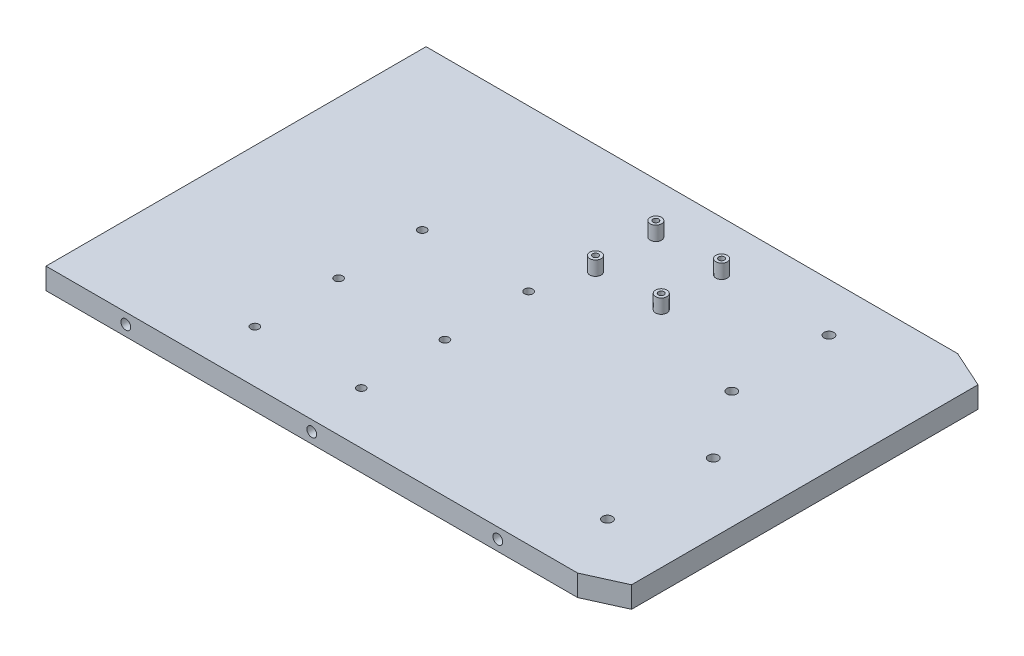
ISO-10303-21;
HEADER;
FILE_DESCRIPTION(('STEP AP214'),'2;1');
FILE_NAME('part.step','',(''),(''),'','','');
FILE_SCHEMA(('AUTOMOTIVE_DESIGN { 1 0 10303 214 1 1 1 1 }'));
ENDSEC;
DATA;
#1=APPLICATION_CONTEXT('core data for automotive mechanical design processes');
#2=APPLICATION_PROTOCOL_DEFINITION('international standard','automotive_design',2000,#1);
#3=PRODUCT_CONTEXT('',#1,'mechanical');
#4=PRODUCT('Part','Part','',(#3));
#5=PRODUCT_RELATED_PRODUCT_CATEGORY('part','',(#4));
#6=PRODUCT_DEFINITION_FORMATION('','',#4);
#7=PRODUCT_DEFINITION_CONTEXT('part definition',#1,'design');
#8=PRODUCT_DEFINITION('design','',#6,#7);
#9=PRODUCT_DEFINITION_SHAPE('','',#8);
#10=(LENGTH_UNIT() NAMED_UNIT(*) SI_UNIT(.MILLI.,.METRE.));
#11=(NAMED_UNIT(*) PLANE_ANGLE_UNIT() SI_UNIT($,.RADIAN.));
#12=(NAMED_UNIT(*) SI_UNIT($,.STERADIAN.) SOLID_ANGLE_UNIT());
#13=UNCERTAINTY_MEASURE_WITH_UNIT(LENGTH_MEASURE(1.E-05),#10,'distance_accuracy_value','');
#14=(GEOMETRIC_REPRESENTATION_CONTEXT(3) GLOBAL_UNCERTAINTY_ASSIGNED_CONTEXT((#13)) GLOBAL_UNIT_ASSIGNED_CONTEXT((#10,
#11,#12)) REPRESENTATION_CONTEXT('',''));
#15=CARTESIAN_POINT('',(0.,0.,0.));
#16=DIRECTION('',(0.,0.,1.));
#17=DIRECTION('',(1.,0.,0.));
#18=AXIS2_PLACEMENT_3D('',#15,#16,#17);
#19=CARTESIAN_POINT('',(243.541302820561,25.,-239.127002178664));
#20=DIRECTION('',(0.,-1.,0.));
#21=DIRECTION('',(0.,0.,-1.));
#22=AXIS2_PLACEMENT_3D('',#19,#20,#21);
#23=PLANE('',#22);
#24=CARTESIAN_POINT('',(243.541302820561,25.,-239.127002178664));
#25=DIRECTION('',(0.,1.,0.));
#26=DIRECTION('',(0.,0.,-1.));
#27=AXIS2_PLACEMENT_3D('',#24,#25,#26);
#28=CIRCLE('',#27,4.);
#29=CARTESIAN_POINT('',(243.541302820561,25.,-243.127002178664));
#30=VERTEX_POINT('',#29);
#31=EDGE_CURVE('E59',#30,#30,#28,.T.);
#32=ORIENTED_EDGE('',*,*,#31,.T.);
#33=EDGE_LOOP('',(#32));
#34=FACE_BOUND('',#33,.T.);
#35=CARTESIAN_POINT('',(243.541302820561,25.,-239.127002178664));
#36=DIRECTION('',(0.,1.,0.));
#37=DIRECTION('',(0.,0.,-1.));
#38=AXIS2_PLACEMENT_3D('',#35,#36,#37);
#39=CIRCLE('',#38,2.);
#40=CARTESIAN_POINT('',(243.541302820561,25.,-241.127002178664));
#41=VERTEX_POINT('',#40);
#42=EDGE_CURVE('E50',#41,#41,#39,.T.);
#43=ORIENTED_EDGE('',*,*,#42,.F.);
#44=EDGE_LOOP('',(#43));
#45=FACE_BOUND('',#44,.T.);
#46=ADVANCED_FACE('F46',(#34,#45),#23,.F.);
#47=CARTESIAN_POINT('',(243.541302820561,15.,-239.127002178664));
#48=DIRECTION('',(0.,-1.,0.));
#49=DIRECTION('',(0.,0.,-1.));
#50=AXIS2_PLACEMENT_3D('',#47,#48,#49);
#51=PLANE('',#50);
#52=CARTESIAN_POINT('',(243.541302820561,15.,-239.127002178664));
#53=DIRECTION('',(0.,1.,0.));
#54=DIRECTION('',(0.,0.,-1.));
#55=AXIS2_PLACEMENT_3D('',#52,#53,#54);
#56=CIRCLE('',#55,4.);
#57=CARTESIAN_POINT('',(243.541302820561,15.,-243.127002178664));
#58=VERTEX_POINT('',#57);
#59=EDGE_CURVE('E57',#58,#58,#56,.T.);
#60=ORIENTED_EDGE('',*,*,#59,.F.);
#61=EDGE_LOOP('',(#60));
#62=FACE_BOUND('',#61,.T.);
#63=CARTESIAN_POINT('',(243.541302820561,15.,-239.127002178664));
#64=DIRECTION('',(0.,1.,0.));
#65=DIRECTION('',(0.,0.,-1.));
#66=AXIS2_PLACEMENT_3D('',#63,#64,#65);
#67=CIRCLE('',#66,2.);
#68=CARTESIAN_POINT('',(243.541302820561,15.,-241.127002178664));
#69=VERTEX_POINT('',#68);
#70=EDGE_CURVE('E11',#69,#69,#67,.T.);
#71=ORIENTED_EDGE('',*,*,#70,.T.);
#72=EDGE_LOOP('',(#71));
#73=FACE_BOUND('',#72,.T.);
#74=ADVANCED_FACE('F67',(#62,#73),#51,.T.);
#75=CARTESIAN_POINT('',(243.541302820561,25.,-239.127002178664));
#76=DIRECTION('',(0.,-1.,0.));
#77=DIRECTION('',(0.,0.,-1.));
#78=AXIS2_PLACEMENT_3D('',#75,#76,#77);
#79=CYLINDRICAL_SURFACE('',#78,4.);
#80=ORIENTED_EDGE('',*,*,#31,.F.);
#81=EDGE_LOOP('',(#80));
#82=FACE_BOUND('',#81,.T.);
#83=ORIENTED_EDGE('',*,*,#59,.T.);
#84=EDGE_LOOP('',(#83));
#85=FACE_BOUND('',#84,.T.);
#86=ADVANCED_FACE('F65',(#82,#85),#79,.T.);
#87=CARTESIAN_POINT('',(243.541302820561,25.,-239.127002178664));
#88=DIRECTION('',(0.,-1.,0.));
#89=DIRECTION('',(0.,0.,-1.));
#90=AXIS2_PLACEMENT_3D('',#87,#88,#89);
#91=CYLINDRICAL_SURFACE('',#90,2.);
#92=ORIENTED_EDGE('',*,*,#42,.T.);
#93=EDGE_LOOP('',(#92));
#94=FACE_BOUND('',#93,.T.);
#95=ORIENTED_EDGE('',*,*,#70,.F.);
#96=EDGE_LOOP('',(#95));
#97=FACE_BOUND('',#96,.T.);
#98=ADVANCED_FACE('F48',(#94,#97),#91,.F.);
#99=CLOSED_SHELL('',(#46,#74,#86,#98));
#100=MANIFOLD_SOLID_BREP('B2',#99);
#101=CARTESIAN_POINT('',(197.186302820561,25.,-239.127002178664));
#102=DIRECTION('',(0.,-1.,0.));
#103=DIRECTION('',(0.,0.,-1.));
#104=AXIS2_PLACEMENT_3D('',#101,#102,#103);
#105=PLANE('',#104);
#106=CARTESIAN_POINT('',(197.186302820561,25.,-239.127002178664));
#107=DIRECTION('',(0.,1.,0.));
#108=DIRECTION('',(0.,0.,-1.));
#109=AXIS2_PLACEMENT_3D('',#106,#107,#108);
#110=CIRCLE('',#109,3.99999999999999);
#111=CARTESIAN_POINT('',(197.186302820561,25.,-243.127002178664));
#112=VERTEX_POINT('',#111);
#113=EDGE_CURVE('E137',#112,#112,#110,.T.);
#114=ORIENTED_EDGE('',*,*,#113,.T.);
#115=EDGE_LOOP('',(#114));
#116=FACE_BOUND('',#115,.T.);
#117=CARTESIAN_POINT('',(197.186302820561,25.,-239.127002178664));
#118=DIRECTION('',(0.,1.,0.));
#119=DIRECTION('',(0.,0.,-1.));
#120=AXIS2_PLACEMENT_3D('',#117,#118,#119);
#121=CIRCLE('',#120,2.);
#122=CARTESIAN_POINT('',(197.186302820561,25.,-241.127002178664));
#123=VERTEX_POINT('',#122);
#124=EDGE_CURVE('E128',#123,#123,#121,.T.);
#125=ORIENTED_EDGE('',*,*,#124,.F.);
#126=EDGE_LOOP('',(#125));
#127=FACE_BOUND('',#126,.T.);
#128=ADVANCED_FACE('F124',(#116,#127),#105,.F.);
#129=CARTESIAN_POINT('',(197.186302820561,15.,-239.127002178664));
#130=DIRECTION('',(0.,-1.,0.));
#131=DIRECTION('',(0.,0.,-1.));
#132=AXIS2_PLACEMENT_3D('',#129,#130,#131);
#133=PLANE('',#132);
#134=CARTESIAN_POINT('',(197.186302820561,15.,-239.127002178664));
#135=DIRECTION('',(0.,1.,0.));
#136=DIRECTION('',(0.,0.,-1.));
#137=AXIS2_PLACEMENT_3D('',#134,#135,#136);
#138=CIRCLE('',#137,3.99999999999999);
#139=CARTESIAN_POINT('',(197.186302820561,15.,-243.127002178664));
#140=VERTEX_POINT('',#139);
#141=EDGE_CURVE('E135',#140,#140,#138,.T.);
#142=ORIENTED_EDGE('',*,*,#141,.F.);
#143=EDGE_LOOP('',(#142));
#144=FACE_BOUND('',#143,.T.);
#145=CARTESIAN_POINT('',(197.186302820561,15.,-239.127002178664));
#146=DIRECTION('',(0.,1.,0.));
#147=DIRECTION('',(0.,0.,-1.));
#148=AXIS2_PLACEMENT_3D('',#145,#146,#147);
#149=CIRCLE('',#148,2.);
#150=CARTESIAN_POINT('',(197.186302820561,15.,-241.127002178664));
#151=VERTEX_POINT('',#150);
#152=EDGE_CURVE('E45',#151,#151,#149,.T.);
#153=ORIENTED_EDGE('',*,*,#152,.T.);
#154=EDGE_LOOP('',(#153));
#155=FACE_BOUND('',#154,.T.);
#156=ADVANCED_FACE('F145',(#144,#155),#133,.T.);
#157=CARTESIAN_POINT('',(197.186302820561,25.,-239.127002178664));
#158=DIRECTION('',(0.,-1.,0.));
#159=DIRECTION('',(0.,0.,-1.));
#160=AXIS2_PLACEMENT_3D('',#157,#158,#159);
#161=CYLINDRICAL_SURFACE('',#160,3.99999999999999);
#162=ORIENTED_EDGE('',*,*,#113,.F.);
#163=EDGE_LOOP('',(#162));
#164=FACE_BOUND('',#163,.T.);
#165=ORIENTED_EDGE('',*,*,#141,.T.);
#166=EDGE_LOOP('',(#165));
#167=FACE_BOUND('',#166,.T.);
#168=ADVANCED_FACE('F143',(#164,#167),#161,.T.);
#169=CARTESIAN_POINT('',(197.186302820561,25.,-239.127002178664));
#170=DIRECTION('',(0.,-1.,0.));
#171=DIRECTION('',(0.,0.,-1.));
#172=AXIS2_PLACEMENT_3D('',#169,#170,#171);
#173=CYLINDRICAL_SURFACE('',#172,2.);
#174=ORIENTED_EDGE('',*,*,#124,.T.);
#175=EDGE_LOOP('',(#174));
#176=FACE_BOUND('',#175,.T.);
#177=ORIENTED_EDGE('',*,*,#152,.F.);
#178=EDGE_LOOP('',(#177));
#179=FACE_BOUND('',#178,.T.);
#180=ADVANCED_FACE('F126',(#176,#179),#173,.F.);
#181=CLOSED_SHELL('',(#128,#156,#168,#180));
#182=MANIFOLD_SOLID_BREP('B6',#181);
#183=CARTESIAN_POINT('',(197.186302820561,25.,-196.582002178664));
#184=DIRECTION('',(0.,1.,0.));
#185=DIRECTION('',(0.,0.,1.));
#186=AXIS2_PLACEMENT_3D('',#183,#184,#185);
#187=PLANE('',#186);
#188=CARTESIAN_POINT('',(197.186302820561,25.,-196.582002178664));
#189=DIRECTION('',(0.,1.,0.));
#190=DIRECTION('',(0.,0.,1.));
#191=AXIS2_PLACEMENT_3D('',#188,#189,#190);
#192=CIRCLE('',#191,4.);
#193=CARTESIAN_POINT('',(197.186302820561,25.,-192.582002178664));
#194=VERTEX_POINT('',#193);
#195=EDGE_CURVE('E215',#194,#194,#192,.T.);
#196=ORIENTED_EDGE('',*,*,#195,.T.);
#197=EDGE_LOOP('',(#196));
#198=FACE_BOUND('',#197,.T.);
#199=CARTESIAN_POINT('',(197.186302820561,25.,-196.582002178664));
#200=DIRECTION('',(0.,1.,0.));
#201=DIRECTION('',(0.,0.,1.));
#202=AXIS2_PLACEMENT_3D('',#199,#200,#201);
#203=CIRCLE('',#202,2.);
#204=CARTESIAN_POINT('',(197.186302820561,25.,-194.582002178664));
#205=VERTEX_POINT('',#204);
#206=EDGE_CURVE('E206',#205,#205,#203,.T.);
#207=ORIENTED_EDGE('',*,*,#206,.F.);
#208=EDGE_LOOP('',(#207));
#209=FACE_BOUND('',#208,.T.);
#210=ADVANCED_FACE('F202',(#198,#209),#187,.T.);
#211=CARTESIAN_POINT('',(197.186302820561,15.,-196.582002178664));
#212=DIRECTION('',(0.,1.,0.));
#213=DIRECTION('',(0.,0.,1.));
#214=AXIS2_PLACEMENT_3D('',#211,#212,#213);
#215=PLANE('',#214);
#216=CARTESIAN_POINT('',(197.186302820561,15.,-196.582002178664));
#217=DIRECTION('',(0.,1.,0.));
#218=DIRECTION('',(0.,0.,1.));
#219=AXIS2_PLACEMENT_3D('',#216,#217,#218);
#220=CIRCLE('',#219,4.);
#221=CARTESIAN_POINT('',(197.186302820561,15.,-192.582002178664));
#222=VERTEX_POINT('',#221);
#223=EDGE_CURVE('E213',#222,#222,#220,.T.);
#224=ORIENTED_EDGE('',*,*,#223,.F.);
#225=EDGE_LOOP('',(#224));
#226=FACE_BOUND('',#225,.T.);
#227=CARTESIAN_POINT('',(197.186302820561,15.,-196.582002178664));
#228=DIRECTION('',(0.,1.,0.));
#229=DIRECTION('',(0.,0.,1.));
#230=AXIS2_PLACEMENT_3D('',#227,#228,#229);
#231=CIRCLE('',#230,2.);
#232=CARTESIAN_POINT('',(197.186302820561,15.,-194.582002178664));
#233=VERTEX_POINT('',#232);
#234=EDGE_CURVE('E123',#233,#233,#231,.T.);
#235=ORIENTED_EDGE('',*,*,#234,.T.);
#236=EDGE_LOOP('',(#235));
#237=FACE_BOUND('',#236,.T.);
#238=ADVANCED_FACE('F223',(#226,#237),#215,.F.);
#239=CARTESIAN_POINT('',(197.186302820561,25.,-196.582002178664));
#240=DIRECTION('',(0.,-1.,0.));
#241=DIRECTION('',(0.,0.,-1.));
#242=AXIS2_PLACEMENT_3D('',#239,#240,#241);
#243=CYLINDRICAL_SURFACE('',#242,4.);
#244=ORIENTED_EDGE('',*,*,#195,.F.);
#245=EDGE_LOOP('',(#244));
#246=FACE_BOUND('',#245,.T.);
#247=ORIENTED_EDGE('',*,*,#223,.T.);
#248=EDGE_LOOP('',(#247));
#249=FACE_BOUND('',#248,.T.);
#250=ADVANCED_FACE('F221',(#246,#249),#243,.T.);
#251=CARTESIAN_POINT('',(197.186302820561,25.,-196.582002178664));
#252=DIRECTION('',(0.,-1.,0.));
#253=DIRECTION('',(0.,0.,-1.));
#254=AXIS2_PLACEMENT_3D('',#251,#252,#253);
#255=CYLINDRICAL_SURFACE('',#254,2.);
#256=ORIENTED_EDGE('',*,*,#206,.T.);
#257=EDGE_LOOP('',(#256));
#258=FACE_BOUND('',#257,.T.);
#259=ORIENTED_EDGE('',*,*,#234,.F.);
#260=EDGE_LOOP('',(#259));
#261=FACE_BOUND('',#260,.T.);
#262=ADVANCED_FACE('F204',(#258,#261),#255,.F.);
#263=CLOSED_SHELL('',(#210,#238,#250,#262));
#264=MANIFOLD_SOLID_BREP('B40',#263);
#265=CARTESIAN_POINT('',(243.541302820561,25.,-196.582002178664));
#266=DIRECTION('',(0.,1.,0.));
#267=DIRECTION('',(0.,0.,1.));
#268=AXIS2_PLACEMENT_3D('',#265,#266,#267);
#269=PLANE('',#268);
#270=CARTESIAN_POINT('',(243.541302820561,25.,-196.582002178664));
#271=DIRECTION('',(0.,1.,0.));
#272=DIRECTION('',(0.,0.,1.));
#273=AXIS2_PLACEMENT_3D('',#270,#271,#272);
#274=CIRCLE('',#273,4.);
#275=CARTESIAN_POINT('',(243.541302820561,25.,-192.582002178664));
#276=VERTEX_POINT('',#275);
#277=EDGE_CURVE('E201',#276,#276,#274,.T.);
#278=ORIENTED_EDGE('',*,*,#277,.T.);
#279=EDGE_LOOP('',(#278));
#280=FACE_BOUND('',#279,.T.);
#281=CARTESIAN_POINT('',(243.541302820561,25.,-196.582002178664));
#282=DIRECTION('',(0.,1.,0.));
#283=DIRECTION('',(0.,0.,1.));
#284=AXIS2_PLACEMENT_3D('',#281,#282,#283);
#285=CIRCLE('',#284,2.);
#286=CARTESIAN_POINT('',(243.541302820561,25.,-194.582002178664));
#287=VERTEX_POINT('',#286);
#288=EDGE_CURVE('E292',#287,#287,#285,.T.);
#289=ORIENTED_EDGE('',*,*,#288,.F.);
#290=EDGE_LOOP('',(#289));
#291=FACE_BOUND('',#290,.T.);
#292=ADVANCED_FACE('F281',(#280,#291),#269,.T.);
#293=CARTESIAN_POINT('',(243.541302820561,15.,-196.582002178664));
#294=DIRECTION('',(0.,1.,0.));
#295=DIRECTION('',(0.,0.,1.));
#296=AXIS2_PLACEMENT_3D('',#293,#294,#295);
#297=PLANE('',#296);
#298=CARTESIAN_POINT('',(243.541302820561,15.,-196.582002178664));
#299=DIRECTION('',(0.,1.,0.));
#300=DIRECTION('',(0.,0.,1.));
#301=AXIS2_PLACEMENT_3D('',#298,#299,#300);
#302=CIRCLE('',#301,4.);
#303=CARTESIAN_POINT('',(243.541302820561,15.,-192.582002178664));
#304=VERTEX_POINT('',#303);
#305=EDGE_CURVE('E285',#304,#304,#302,.T.);
#306=ORIENTED_EDGE('',*,*,#305,.F.);
#307=EDGE_LOOP('',(#306));
#308=FACE_BOUND('',#307,.T.);
#309=CARTESIAN_POINT('',(243.541302820561,15.,-196.582002178664));
#310=DIRECTION('',(0.,1.,0.));
#311=DIRECTION('',(0.,0.,1.));
#312=AXIS2_PLACEMENT_3D('',#309,#310,#311);
#313=CIRCLE('',#312,2.);
#314=CARTESIAN_POINT('',(243.541302820561,15.,-194.582002178664));
#315=VERTEX_POINT('',#314);
#316=EDGE_CURVE('E294',#315,#315,#313,.T.);
#317=ORIENTED_EDGE('',*,*,#316,.T.);
#318=EDGE_LOOP('',(#317));
#319=FACE_BOUND('',#318,.T.);
#320=ADVANCED_FACE('F304',(#308,#319),#297,.F.);
#321=CARTESIAN_POINT('',(243.541302820561,25.,-196.582002178664));
#322=DIRECTION('',(0.,-1.,0.));
#323=DIRECTION('',(0.,0.,-1.));
#324=AXIS2_PLACEMENT_3D('',#321,#322,#323);
#325=CYLINDRICAL_SURFACE('',#324,4.);
#326=ORIENTED_EDGE('',*,*,#277,.F.);
#327=EDGE_LOOP('',(#326));
#328=FACE_BOUND('',#327,.T.);
#329=ORIENTED_EDGE('',*,*,#305,.T.);
#330=EDGE_LOOP('',(#329));
#331=FACE_BOUND('',#330,.T.);
#332=ADVANCED_FACE('F283',(#328,#331),#325,.T.);
#333=CARTESIAN_POINT('',(243.541302820561,25.,-196.582002178664));
#334=DIRECTION('',(0.,-1.,0.));
#335=DIRECTION('',(0.,0.,-1.));
#336=AXIS2_PLACEMENT_3D('',#333,#334,#335);
#337=CYLINDRICAL_SURFACE('',#336,2.);
#338=ORIENTED_EDGE('',*,*,#288,.T.);
#339=EDGE_LOOP('',(#338));
#340=FACE_BOUND('',#339,.T.);
#341=ORIENTED_EDGE('',*,*,#316,.F.);
#342=EDGE_LOOP('',(#341));
#343=FACE_BOUND('',#342,.T.);
#344=ADVANCED_FACE('F300',(#340,#343),#337,.F.);
#345=CLOSED_SHELL('',(#292,#320,#332,#344));
#346=MANIFOLD_SOLID_BREP('B118',#345);
#347=CARTESIAN_POINT('',(374.81,10.,-12.0330845771143));
#348=DIRECTION('',(0.,0.,-1.));
#349=DIRECTION('',(-1.,0.,0.));
#350=AXIS2_PLACEMENT_3D('',#347,#348,#349);
#351=PLANE('',#350);
#352=CARTESIAN_POINT('',(187.405,7.5,-12.0330845771144));
#353=DIRECTION('',(0.,0.,1.));
#354=DIRECTION('',(1.,0.,0.));
#355=AXIS2_PLACEMENT_3D('',#352,#353,#354);
#356=CIRCLE('',#355,3.45500000000002);
#357=CARTESIAN_POINT('',(190.86,7.5,-12.0330845771144));
#358=VERTEX_POINT('',#357);
#359=EDGE_CURVE('E502',#358,#358,#356,.T.);
#360=ORIENTED_EDGE('',*,*,#359,.T.);
#361=EDGE_LOOP('',(#360));
#362=FACE_BOUND('',#361,.T.);
#363=ADVANCED_FACE('F351',(#362),#351,.F.);
#364=CARTESIAN_POINT('',(56.2694258644328,7.5,-12.0330845771144));
#365=DIRECTION('',(0.,0.,1.));
#366=DIRECTION('',(1.,0.,0.));
#367=AXIS2_PLACEMENT_3D('',#364,#365,#366);
#368=CIRCLE('',#367,3.45500000000002);
#369=CARTESIAN_POINT('',(59.7244258644328,7.5,-12.0330845771144));
#370=VERTEX_POINT('',#369);
#371=EDGE_CURVE('E492',#370,#370,#368,.T.);
#372=ORIENTED_EDGE('',*,*,#371,.T.);
#373=EDGE_LOOP('',(#372));
#374=FACE_BOUND('',#373,.T.);
#375=ADVANCED_FACE('F467',(#374),#351,.F.);
#376=CARTESIAN_POINT('',(318.540574135567,7.5,-12.0330845771144));
#377=DIRECTION('',(0.,0.,1.));
#378=DIRECTION('',(-1.,0.,0.));
#379=AXIS2_PLACEMENT_3D('',#376,#377,#378);
#380=CIRCLE('',#379,3.45500000000004);
#381=CARTESIAN_POINT('',(315.085574135567,7.5,-12.0330845771144));
#382=VERTEX_POINT('',#381);
#383=EDGE_CURVE('E486',#382,#382,#380,.T.);
#384=ORIENTED_EDGE('',*,*,#383,.T.);
#385=EDGE_LOOP('',(#384));
#386=FACE_BOUND('',#385,.T.);
#387=ADVANCED_FACE('F470',(#386),#351,.F.);
#388=CARTESIAN_POINT('',(401.01,10.,-18.185));
#389=DIRECTION('',(-0.412154431079065,0.,-0.911114002165422));
#390=DIRECTION('',(-0.911114002165422,0.,0.412154431079065));
#391=AXIS2_PLACEMENT_3D('',#388,#389,#390);
#392=PLANE('',#391);
#393=DIRECTION('',(0.911114002165422,0.,-0.412154431079065));
#394=VECTOR('',#393,1.);
#395=CARTESIAN_POINT('',(401.01,0.,-18.185));
#396=LINE('',#395,#394);
#397=CARTESIAN_POINT('',(374.81,0.,-6.33308457711444));
#398=VERTEX_POINT('',#397);
#399=CARTESIAN_POINT('',(401.01,0.,-18.185));
#400=VERTEX_POINT('',#399);
#401=EDGE_CURVE('E428',#398,#400,#396,.T.);
#402=ORIENTED_EDGE('',*,*,#401,.T.);
#403=DIRECTION('',(0.,-1.,0.));
#404=VECTOR('',#403,1.);
#405=CARTESIAN_POINT('',(401.01,10.,-18.185));
#406=LINE('',#405,#404);
#407=CARTESIAN_POINT('',(401.01,15.,-18.185));
#408=VERTEX_POINT('',#407);
#409=EDGE_CURVE('E435',#408,#400,#406,.T.);
#410=ORIENTED_EDGE('',*,*,#409,.F.);
#411=DIRECTION('',(0.911114002165422,0.,-0.412154431079065));
#412=VECTOR('',#411,1.);
#413=CARTESIAN_POINT('',(61.2912547537158,15.,135.491253291138));
#414=LINE('',#413,#412);
#415=CARTESIAN_POINT('',(374.81,15.,-6.33308457711435));
#416=VERTEX_POINT('',#415);
#417=EDGE_CURVE('E547',#416,#408,#414,.T.);
#418=ORIENTED_EDGE('',*,*,#417,.F.);
#419=DIRECTION('',(0.,-1.,0.));
#420=VECTOR('',#419,1.);
#421=CARTESIAN_POINT('',(374.81,10.,-6.33308457711435));
#422=LINE('',#421,#420);
#423=EDGE_CURVE('E423',#416,#398,#422,.T.);
#424=ORIENTED_EDGE('',*,*,#423,.T.);
#425=EDGE_LOOP('',(#402,#410,#418,#424));
#426=FACE_BOUND('',#425,.T.);
#427=ADVANCED_FACE('F353',(#426),#392,.F.);
#428=CARTESIAN_POINT('',(401.01,10.,-18.185));
#429=DIRECTION('',(-1.,0.,0.));
#430=DIRECTION('',(0.,0.,1.));
#431=AXIS2_PLACEMENT_3D('',#428,#429,#430);
#432=PLANE('',#431);
#433=DIRECTION('',(0.,0.,-1.));
#434=VECTOR('',#433,1.);
#435=CARTESIAN_POINT('',(401.01,0.,-18.185));
#436=LINE('',#435,#434);
#437=CARTESIAN_POINT('',(401.01,0.,-262.445));
#438=VERTEX_POINT('',#437);
#439=EDGE_CURVE('E366',#400,#438,#436,.T.);
#440=ORIENTED_EDGE('',*,*,#439,.T.);
#441=DIRECTION('',(0.,-1.,0.));
#442=VECTOR('',#441,1.);
#443=CARTESIAN_POINT('',(401.01,10.,-262.445));
#444=LINE('',#443,#442);
#445=CARTESIAN_POINT('',(401.01,15.,-262.445));
#446=VERTEX_POINT('',#445);
#447=EDGE_CURVE('E422',#446,#438,#444,.T.);
#448=ORIENTED_EDGE('',*,*,#447,.F.);
#449=DIRECTION('',(0.,0.,-1.));
#450=VECTOR('',#449,1.);
#451=CARTESIAN_POINT('',(401.01,15.,0.));
#452=LINE('',#451,#450);
#453=EDGE_CURVE('E549',#408,#446,#452,.T.);
#454=ORIENTED_EDGE('',*,*,#453,.F.);
#455=ORIENTED_EDGE('',*,*,#409,.T.);
#456=EDGE_LOOP('',(#440,#448,#454,#455));
#457=FACE_BOUND('',#456,.T.);
#458=ADVANCED_FACE('F482',(#457),#432,.F.);
#459=CARTESIAN_POINT('',(401.01,10.,-262.445));
#460=DIRECTION('',(-0.412154431079065,0.,0.911114002165422));
#461=DIRECTION('',(0.911114002165422,0.,0.412154431079065));
#462=AXIS2_PLACEMENT_3D('',#459,#460,#461);
#463=PLANE('',#462);
#464=DIRECTION('',(-0.911114002165422,0.,-0.412154431079065));
#465=VECTOR('',#464,1.);
#466=CARTESIAN_POINT('',(401.01,0.,-262.445));
#467=LINE('',#466,#465);
#468=CARTESIAN_POINT('',(374.81,0.,-274.296915422886));
#469=VERTEX_POINT('',#468);
#470=EDGE_CURVE('E404',#438,#469,#467,.T.);
#471=ORIENTED_EDGE('',*,*,#470,.T.);
#472=DIRECTION('',(0.,-1.,0.));
#473=VECTOR('',#472,1.);
#474=CARTESIAN_POINT('',(374.81,10.,-274.296915422886));
#475=LINE('',#474,#473);
#476=CARTESIAN_POINT('',(374.81,15.,-274.296915422886));
#477=VERTEX_POINT('',#476);
#478=EDGE_CURVE('E414',#477,#469,#475,.T.);
#479=ORIENTED_EDGE('',*,*,#478,.F.);
#480=DIRECTION('',(-0.911114002165422,0.,-0.412154431079065));
#481=VECTOR('',#480,1.);
#482=CARTESIAN_POINT('',(166.673340646823,15.,-368.450277371581));
#483=LINE('',#482,#481);
#484=EDGE_CURVE('E552',#446,#477,#483,.T.);
#485=ORIENTED_EDGE('',*,*,#484,.F.);
#486=ORIENTED_EDGE('',*,*,#447,.T.);
#487=EDGE_LOOP('',(#471,#479,#485,#486));
#488=FACE_BOUND('',#487,.T.);
#489=ADVANCED_FACE('F425',(#488),#463,.F.);
#490=CARTESIAN_POINT('',(0.,10.,-12.0330845771144));
#491=DIRECTION('',(1.,0.,0.));
#492=DIRECTION('',(0.,0.,-1.));
#493=AXIS2_PLACEMENT_3D('',#490,#491,#492);
#494=PLANE('',#493);
#495=DIRECTION('',(0.,0.,1.));
#496=VECTOR('',#495,1.);
#497=CARTESIAN_POINT('',(0.,0.,-12.0330845771144));
#498=LINE('',#497,#496);
#499=CARTESIAN_POINT('',(0.,0.,-274.296915422886));
#500=VERTEX_POINT('',#499);
#501=CARTESIAN_POINT('',(0.,0.,-6.33308457711444));
#502=VERTEX_POINT('',#501);
#503=EDGE_CURVE('E406',#500,#502,#498,.T.);
#504=ORIENTED_EDGE('',*,*,#503,.T.);
#505=DIRECTION('',(0.,-1.,0.));
#506=VECTOR('',#505,1.);
#507=CARTESIAN_POINT('',(0.,0.,-6.33308457711444));
#508=LINE('',#507,#506);
#509=CARTESIAN_POINT('',(0.,15.,-6.33308457711444));
#510=VERTEX_POINT('',#509);
#511=EDGE_CURVE('E508',#510,#502,#508,.T.);
#512=ORIENTED_EDGE('',*,*,#511,.F.);
#513=DIRECTION('',(0.,0.,-1.));
#514=VECTOR('',#513,1.);
#515=CARTESIAN_POINT('',(0.,15.,-6.33308457711444));
#516=LINE('',#515,#514);
#517=CARTESIAN_POINT('',(0.,15.,-274.296915422886));
#518=VERTEX_POINT('',#517);
#519=EDGE_CURVE('E517',#510,#518,#516,.T.);
#520=ORIENTED_EDGE('',*,*,#519,.T.);
#521=DIRECTION('',(0.,1.,0.));
#522=VECTOR('',#521,1.);
#523=CARTESIAN_POINT('',(0.,0.,-274.296915422886));
#524=LINE('',#523,#522);
#525=EDGE_CURVE('E410',#500,#518,#524,.T.);
#526=ORIENTED_EDGE('',*,*,#525,.F.);
#527=EDGE_LOOP('',(#504,#512,#520,#526));
#528=FACE_BOUND('',#527,.T.);
#529=ADVANCED_FACE('F528',(#528),#494,.F.);
#530=CARTESIAN_POINT('',(0.,0.,0.));
#531=DIRECTION('',(0.,-1.,0.));
#532=DIRECTION('',(0.,0.,-1.));
#533=AXIS2_PLACEMENT_3D('',#530,#531,#532);
#534=PLANE('',#533);
#535=ORIENTED_EDGE('',*,*,#503,.F.);
#536=DIRECTION('',(-1.,0.,0.));
#537=VECTOR('',#536,1.);
#538=CARTESIAN_POINT('',(374.81,0.,-274.296915422886));
#539=LINE('',#538,#537);
#540=EDGE_CURVE('E400',#469,#500,#539,.T.);
#541=ORIENTED_EDGE('',*,*,#540,.F.);
#542=ORIENTED_EDGE('',*,*,#470,.F.);
#543=ORIENTED_EDGE('',*,*,#439,.F.);
#544=ORIENTED_EDGE('',*,*,#401,.F.);
#545=DIRECTION('',(1.,0.,0.));
#546=VECTOR('',#545,1.);
#547=CARTESIAN_POINT('',(0.,0.,-6.33308457711444));
#548=LINE('',#547,#546);
#549=EDGE_CURVE('E512',#502,#398,#548,.T.);
#550=ORIENTED_EDGE('',*,*,#549,.F.);
#551=EDGE_LOOP('',(#535,#541,#542,#543,#544,#550));
#552=FACE_BOUND('',#551,.T.);
#553=ADVANCED_FACE('F402',(#552),#534,.T.);
#554=CARTESIAN_POINT('',(0.,0.,-6.33308457711444));
#555=DIRECTION('',(0.,0.,-1.));
#556=DIRECTION('',(-1.,0.,0.));
#557=AXIS2_PLACEMENT_3D('',#554,#555,#556);
#558=PLANE('',#557);
#559=ORIENTED_EDGE('',*,*,#511,.T.);
#560=ORIENTED_EDGE('',*,*,#549,.T.);
#561=ORIENTED_EDGE('',*,*,#423,.F.);
#562=DIRECTION('',(-1.,0.,0.));
#563=VECTOR('',#562,1.);
#564=CARTESIAN_POINT('',(0.,15.,-6.33308457711444));
#565=LINE('',#564,#563);
#566=EDGE_CURVE('E515',#416,#510,#565,.T.);
#567=ORIENTED_EDGE('',*,*,#566,.T.);
#568=EDGE_LOOP('',(#559,#560,#561,#567));
#569=FACE_BOUND('',#568,.T.);
#570=CARTESIAN_POINT('',(187.405,7.5,-6.33308457711444));
#571=DIRECTION('',(0.,0.,1.));
#572=DIRECTION('',(1.,0.,0.));
#573=AXIS2_PLACEMENT_3D('',#570,#571,#572);
#574=CIRCLE('',#573,3.45500000000002);
#575=CARTESIAN_POINT('',(190.86,7.5,-6.33308457711444));
#576=VERTEX_POINT('',#575);
#577=EDGE_CURVE('E505',#576,#576,#574,.T.);
#578=ORIENTED_EDGE('',*,*,#577,.F.);
#579=EDGE_LOOP('',(#578));
#580=FACE_BOUND('',#579,.T.);
#581=CARTESIAN_POINT('',(56.2694258644328,7.5,-6.33308457711444));
#582=DIRECTION('',(0.,0.,1.));
#583=DIRECTION('',(1.,0.,0.));
#584=AXIS2_PLACEMENT_3D('',#581,#582,#583);
#585=CIRCLE('',#584,3.45500000000002);
#586=CARTESIAN_POINT('',(59.7244258644328,7.5,-6.33308457711444));
#587=VERTEX_POINT('',#586);
#588=EDGE_CURVE('E499',#587,#587,#585,.T.);
#589=ORIENTED_EDGE('',*,*,#588,.F.);
#590=EDGE_LOOP('',(#589));
#591=FACE_BOUND('',#590,.T.);
#592=CARTESIAN_POINT('',(318.540574135567,7.5,-6.33308457711444));
#593=DIRECTION('',(0.,0.,1.));
#594=DIRECTION('',(-1.,0.,0.));
#595=AXIS2_PLACEMENT_3D('',#592,#593,#594);
#596=CIRCLE('',#595,3.45500000000004);
#597=CARTESIAN_POINT('',(315.085574135567,7.5,-6.33308457711444));
#598=VERTEX_POINT('',#597);
#599=EDGE_CURVE('E488',#598,#598,#596,.T.);
#600=ORIENTED_EDGE('',*,*,#599,.F.);
#601=EDGE_LOOP('',(#600));
#602=FACE_BOUND('',#601,.T.);
#603=ADVANCED_FACE('F523',(#569,#580,#591,#602),#558,.F.);
#604=CARTESIAN_POINT('',(0.,15.,-6.33308457711444));
#605=DIRECTION('',(0.,-1.,0.));
#606=DIRECTION('',(0.,0.,-1.));
#607=AXIS2_PLACEMENT_3D('',#604,#605,#606);
#608=PLANE('',#607);
#609=DIRECTION('',(1.,0.,0.));
#610=VECTOR('',#609,1.);
#611=CARTESIAN_POINT('',(374.81,15.,-274.296915422886));
#612=LINE('',#611,#610);
#613=EDGE_CURVE('E418',#518,#477,#612,.T.);
#614=ORIENTED_EDGE('',*,*,#613,.F.);
#615=ORIENTED_EDGE('',*,*,#519,.F.);
#616=ORIENTED_EDGE('',*,*,#566,.F.);
#617=ORIENTED_EDGE('',*,*,#417,.T.);
#618=ORIENTED_EDGE('',*,*,#453,.T.);
#619=ORIENTED_EDGE('',*,*,#484,.T.);
#620=EDGE_LOOP('',(#614,#615,#616,#617,#618,#619));
#621=FACE_BOUND('',#620,.T.);
#622=CARTESIAN_POINT('',(110.598476411571,15.,-161.016832693731));
#623=DIRECTION('',(0.,1.,0.));
#624=DIRECTION('',(0.,0.,1.));
#625=AXIS2_PLACEMENT_3D('',#622,#623,#624);
#626=CIRCLE('',#625,2.92500000000001);
#627=CARTESIAN_POINT('',(110.598476411571,15.,-158.091832693731));
#628=VERTEX_POINT('',#627);
#629=EDGE_CURVE('E534',#628,#628,#626,.F.);
#630=ORIENTED_EDGE('',*,*,#629,.T.);
#631=EDGE_LOOP('',(#630));
#632=FACE_BOUND('',#631,.T.);
#633=CARTESIAN_POINT('',(185.598476411571,15.,-43.0168326937307));
#634=DIRECTION('',(0.,1.,0.));
#635=DIRECTION('',(0.,0.,1.));
#636=AXIS2_PLACEMENT_3D('',#633,#634,#635);
#637=CIRCLE('',#636,2.92500000000006);
#638=CARTESIAN_POINT('',(185.598476411571,15.,-40.0918326937307));
#639=VERTEX_POINT('',#638);
#640=EDGE_CURVE('E537',#639,#639,#637,.F.);
#641=ORIENTED_EDGE('',*,*,#640,.T.);
#642=EDGE_LOOP('',(#641));
#643=FACE_BOUND('',#642,.T.);
#644=CARTESIAN_POINT('',(185.598476411571,15.,-161.016832693731));
#645=DIRECTION('',(0.,1.,0.));
#646=DIRECTION('',(0.,0.,1.));
#647=AXIS2_PLACEMENT_3D('',#644,#645,#646);
#648=CIRCLE('',#647,2.92500000000006);
#649=CARTESIAN_POINT('',(185.598476411571,15.,-158.091832693731));
#650=VERTEX_POINT('',#649);
#651=EDGE_CURVE('E541',#650,#650,#648,.T.);
#652=ORIENTED_EDGE('',*,*,#651,.F.);
#653=EDGE_LOOP('',(#652));
#654=FACE_BOUND('',#653,.T.);
#655=CARTESIAN_POINT('',(185.598476411571,15.,-102.016832693731));
#656=DIRECTION('',(0.,1.,0.));
#657=DIRECTION('',(0.,0.,1.));
#658=AXIS2_PLACEMENT_3D('',#655,#656,#657);
#659=CIRCLE('',#658,2.92500000000006);
#660=CARTESIAN_POINT('',(185.598476411571,15.,-99.0918326937307));
#661=VERTEX_POINT('',#660);
#662=EDGE_CURVE('E544',#661,#661,#659,.T.);
#663=ORIENTED_EDGE('',*,*,#662,.F.);
#664=EDGE_LOOP('',(#663));
#665=FACE_BOUND('',#664,.T.);
#666=CARTESIAN_POINT('',(110.598476411571,15.,-43.0168326937307));
#667=DIRECTION('',(0.,1.,0.));
#668=DIRECTION('',(0.,0.,1.));
#669=AXIS2_PLACEMENT_3D('',#666,#667,#668);
#670=CIRCLE('',#669,2.92500000000001);
#671=CARTESIAN_POINT('',(110.598476411571,15.,-40.0918326937307));
#672=VERTEX_POINT('',#671);
#673=EDGE_CURVE('E554',#672,#672,#670,.T.);
#674=ORIENTED_EDGE('',*,*,#673,.F.);
#675=EDGE_LOOP('',(#674));
#676=FACE_BOUND('',#675,.T.);
#677=CARTESIAN_POINT('',(110.598476411571,15.,-102.016832693731));
#678=DIRECTION('',(0.,1.,0.));
#679=DIRECTION('',(0.,0.,1.));
#680=AXIS2_PLACEMENT_3D('',#677,#678,#679);
#681=CIRCLE('',#680,2.92500000000001);
#682=CARTESIAN_POINT('',(110.598476411571,15.,-99.0918326937307));
#683=VERTEX_POINT('',#682);
#684=EDGE_CURVE('E557',#683,#683,#681,.F.);
#685=ORIENTED_EDGE('',*,*,#684,.T.);
#686=EDGE_LOOP('',(#685));
#687=FACE_BOUND('',#686,.T.);
#688=CARTESIAN_POINT('',(352.434052914915,15.,-124.380316664817));
#689=DIRECTION('',(0.,1.,0.));
#690=DIRECTION('',(0.,0.,1.));
#691=AXIS2_PLACEMENT_3D('',#688,#689,#690);
#692=CIRCLE('',#691,3.45499999999999);
#693=CARTESIAN_POINT('',(352.434052914915,15.,-120.925316664817));
#694=VERTEX_POINT('',#693);
#695=EDGE_CURVE('E560',#694,#694,#692,.T.);
#696=ORIENTED_EDGE('',*,*,#695,.F.);
#697=EDGE_LOOP('',(#696));
#698=FACE_BOUND('',#697,.T.);
#699=CARTESIAN_POINT('',(352.434052914915,15.,-49.7303166648173));
#700=DIRECTION('',(0.,1.,0.));
#701=DIRECTION('',(0.,0.,1.));
#702=AXIS2_PLACEMENT_3D('',#699,#700,#701);
#703=CIRCLE('',#702,3.45499999999999);
#704=CARTESIAN_POINT('',(352.434052914915,15.,-46.2753166648173));
#705=VERTEX_POINT('',#704);
#706=EDGE_CURVE('E563',#705,#705,#703,.T.);
#707=ORIENTED_EDGE('',*,*,#706,.F.);
#708=EDGE_LOOP('',(#707));
#709=FACE_BOUND('',#708,.T.);
#710=CARTESIAN_POINT('',(318.184052914915,15.,-240.18469422981));
#711=DIRECTION('',(0.,1.,0.));
#712=DIRECTION('',(0.,0.,1.));
#713=AXIS2_PLACEMENT_3D('',#710,#711,#712);
#714=CIRCLE('',#713,3.45);
#715=CARTESIAN_POINT('',(318.184052914915,15.,-236.73469422981));
#716=VERTEX_POINT('',#715);
#717=EDGE_CURVE('E495',#716,#716,#714,.T.);
#718=ORIENTED_EDGE('',*,*,#717,.F.);
#719=EDGE_LOOP('',(#718));
#720=FACE_BOUND('',#719,.T.);
#721=CARTESIAN_POINT('',(318.184052914915,15.,-171.68469422981));
#722=DIRECTION('',(0.,1.,0.));
#723=DIRECTION('',(0.,0.,1.));
#724=AXIS2_PLACEMENT_3D('',#721,#722,#723);
#725=CIRCLE('',#724,3.45);
#726=CARTESIAN_POINT('',(318.184052914915,15.,-168.23469422981));
#727=VERTEX_POINT('',#726);
#728=EDGE_CURVE('E489',#727,#727,#725,.F.);
#729=ORIENTED_EDGE('',*,*,#728,.T.);
#730=EDGE_LOOP('',(#729));
#731=FACE_BOUND('',#730,.T.);
#732=ADVANCED_FACE('F637',(#621,#632,#643,#654,#665,#676,#687,#698,#709,#720,#731),#608,.F.);
#733=CARTESIAN_POINT('',(187.405,7.5,-6.33308457711444));
#734=DIRECTION('',(0.,0.,-1.));
#735=DIRECTION('',(-1.,0.,0.));
#736=AXIS2_PLACEMENT_3D('',#733,#734,#735);
#737=CYLINDRICAL_SURFACE('',#736,3.45500000000002);
#738=ORIENTED_EDGE('',*,*,#577,.T.);
#739=EDGE_LOOP('',(#738));
#740=FACE_BOUND('',#739,.T.);
#741=ORIENTED_EDGE('',*,*,#359,.F.);
#742=EDGE_LOOP('',(#741));
#743=FACE_BOUND('',#742,.T.);
#744=ADVANCED_FACE('F633',(#740,#743),#737,.F.);
#745=CARTESIAN_POINT('',(56.2694258644328,7.5,-6.33308457711444));
#746=DIRECTION('',(0.,0.,-1.));
#747=DIRECTION('',(-1.,0.,0.));
#748=AXIS2_PLACEMENT_3D('',#745,#746,#747);
#749=CYLINDRICAL_SURFACE('',#748,3.45500000000002);
#750=ORIENTED_EDGE('',*,*,#588,.T.);
#751=EDGE_LOOP('',(#750));
#752=FACE_BOUND('',#751,.T.);
#753=ORIENTED_EDGE('',*,*,#371,.F.);
#754=EDGE_LOOP('',(#753));
#755=FACE_BOUND('',#754,.T.);
#756=ADVANCED_FACE('F598',(#752,#755),#749,.F.);
#757=CARTESIAN_POINT('',(318.540574135567,7.5,-6.33308457711444));
#758=DIRECTION('',(0.,0.,-1.));
#759=DIRECTION('',(-1.,0.,0.));
#760=AXIS2_PLACEMENT_3D('',#757,#758,#759);
#761=CYLINDRICAL_SURFACE('',#760,3.45500000000004);
#762=ORIENTED_EDGE('',*,*,#599,.T.);
#763=EDGE_LOOP('',(#762));
#764=FACE_BOUND('',#763,.T.);
#765=ORIENTED_EDGE('',*,*,#383,.F.);
#766=EDGE_LOOP('',(#765));
#767=FACE_BOUND('',#766,.T.);
#768=ADVANCED_FACE('F588',(#764,#767),#761,.F.);
#769=CARTESIAN_POINT('',(318.184052914915,15.,-240.18469422981));
#770=DIRECTION('',(0.,-1.,0.));
#771=DIRECTION('',(0.,0.,-1.));
#772=AXIS2_PLACEMENT_3D('',#769,#770,#771);
#773=CYLINDRICAL_SURFACE('',#772,3.45);
#774=ORIENTED_EDGE('',*,*,#717,.T.);
#775=EDGE_LOOP('',(#774));
#776=FACE_BOUND('',#775,.T.);
#777=CARTESIAN_POINT('',(318.184052914915,10.,-240.18469422981));
#778=DIRECTION('',(0.,1.,0.));
#779=DIRECTION('',(0.,0.,1.));
#780=AXIS2_PLACEMENT_3D('',#777,#778,#779);
#781=CIRCLE('',#780,3.45);
#782=CARTESIAN_POINT('',(318.184052914915,10.,-236.73469422981));
#783=VERTEX_POINT('',#782);
#784=EDGE_CURVE('E538',#783,#783,#781,.T.);
#785=ORIENTED_EDGE('',*,*,#784,.F.);
#786=EDGE_LOOP('',(#785));
#787=FACE_BOUND('',#786,.T.);
#788=ADVANCED_FACE('F585',(#776,#787),#773,.F.);
#789=CARTESIAN_POINT('',(352.434052914915,15.,-49.7303166648173));
#790=DIRECTION('',(0.,-1.,0.));
#791=DIRECTION('',(0.,0.,-1.));
#792=AXIS2_PLACEMENT_3D('',#789,#790,#791);
#793=CYLINDRICAL_SURFACE('',#792,3.45499999999999);
#794=ORIENTED_EDGE('',*,*,#706,.T.);
#795=EDGE_LOOP('',(#794));
#796=FACE_BOUND('',#795,.T.);
#797=CARTESIAN_POINT('',(352.434052914915,10.,-49.7303166648173));
#798=DIRECTION('',(0.,1.,0.));
#799=DIRECTION('',(0.,0.,1.));
#800=AXIS2_PLACEMENT_3D('',#797,#798,#799);
#801=CIRCLE('',#800,3.45499999999999);
#802=CARTESIAN_POINT('',(352.434052914915,10.,-46.2753166648173));
#803=VERTEX_POINT('',#802);
#804=EDGE_CURVE('E579',#803,#803,#801,.T.);
#805=ORIENTED_EDGE('',*,*,#804,.F.);
#806=EDGE_LOOP('',(#805));
#807=FACE_BOUND('',#806,.T.);
#808=ADVANCED_FACE('F587',(#796,#807),#793,.F.);
#809=CARTESIAN_POINT('',(352.434052914915,15.,-124.380316664817));
#810=DIRECTION('',(0.,-1.,0.));
#811=DIRECTION('',(0.,0.,-1.));
#812=AXIS2_PLACEMENT_3D('',#809,#810,#811);
#813=CYLINDRICAL_SURFACE('',#812,3.45499999999999);
#814=ORIENTED_EDGE('',*,*,#695,.T.);
#815=EDGE_LOOP('',(#814));
#816=FACE_BOUND('',#815,.T.);
#817=CARTESIAN_POINT('',(352.434052914915,10.,-124.380316664817));
#818=DIRECTION('',(0.,1.,0.));
#819=DIRECTION('',(0.,0.,1.));
#820=AXIS2_PLACEMENT_3D('',#817,#818,#819);
#821=CIRCLE('',#820,3.45499999999999);
#822=CARTESIAN_POINT('',(352.434052914915,10.,-120.925316664817));
#823=VERTEX_POINT('',#822);
#824=EDGE_CURVE('E576',#823,#823,#821,.T.);
#825=ORIENTED_EDGE('',*,*,#824,.F.);
#826=EDGE_LOOP('',(#825));
#827=FACE_BOUND('',#826,.T.);
#828=ADVANCED_FACE('F595',(#816,#827),#813,.F.);
#829=CARTESIAN_POINT('',(110.598476411571,15.,-102.016832693731));
#830=DIRECTION('',(0.,-1.,0.));
#831=DIRECTION('',(0.,0.,-1.));
#832=AXIS2_PLACEMENT_3D('',#829,#830,#831);
#833=CYLINDRICAL_SURFACE('',#832,2.92500000000001);
#834=ORIENTED_EDGE('',*,*,#684,.F.);
#835=EDGE_LOOP('',(#834));
#836=FACE_BOUND('',#835,.T.);
#837=CARTESIAN_POINT('',(110.598476411571,10.,-102.016832693731));
#838=DIRECTION('',(0.,-1.,0.));
#839=DIRECTION('',(0.,0.,-1.));
#840=AXIS2_PLACEMENT_3D('',#837,#838,#839);
#841=CIRCLE('',#840,2.92500000000001);
#842=CARTESIAN_POINT('',(110.598476411571,10.,-104.941832693731));
#843=VERTEX_POINT('',#842);
#844=EDGE_CURVE('E279',#843,#843,#841,.T.);
#845=ORIENTED_EDGE('',*,*,#844,.T.);
#846=EDGE_LOOP('',(#845));
#847=FACE_BOUND('',#846,.T.);
#848=ADVANCED_FACE('F607',(#836,#847),#833,.F.);
#849=CARTESIAN_POINT('',(110.598476411571,15.,-43.0168326937307));
#850=DIRECTION('',(0.,-1.,0.));
#851=DIRECTION('',(0.,0.,-1.));
#852=AXIS2_PLACEMENT_3D('',#849,#850,#851);
#853=CYLINDRICAL_SURFACE('',#852,2.92500000000001);
#854=ORIENTED_EDGE('',*,*,#673,.T.);
#855=EDGE_LOOP('',(#854));
#856=FACE_BOUND('',#855,.T.);
#857=CARTESIAN_POINT('',(110.598476411571,10.,-43.0168326937307));
#858=DIRECTION('',(0.,1.,0.));
#859=DIRECTION('',(0.,0.,1.));
#860=AXIS2_PLACEMENT_3D('',#857,#858,#859);
#861=CIRCLE('',#860,2.92500000000001);
#862=CARTESIAN_POINT('',(110.598476411571,10.,-40.0918326937307));
#863=VERTEX_POINT('',#862);
#864=EDGE_CURVE('E573',#863,#863,#861,.T.);
#865=ORIENTED_EDGE('',*,*,#864,.F.);
#866=EDGE_LOOP('',(#865));
#867=FACE_BOUND('',#866,.T.);
#868=ADVANCED_FACE('F611',(#856,#867),#853,.F.);
#869=CARTESIAN_POINT('',(185.598476411571,15.,-102.016832693731));
#870=DIRECTION('',(0.,-1.,0.));
#871=DIRECTION('',(0.,0.,-1.));
#872=AXIS2_PLACEMENT_3D('',#869,#870,#871);
#873=CYLINDRICAL_SURFACE('',#872,2.92500000000006);
#874=ORIENTED_EDGE('',*,*,#662,.T.);
#875=EDGE_LOOP('',(#874));
#876=FACE_BOUND('',#875,.T.);
#877=CARTESIAN_POINT('',(185.598476411571,10.,-102.016832693731));
#878=DIRECTION('',(0.,1.,0.));
#879=DIRECTION('',(0.,0.,1.));
#880=AXIS2_PLACEMENT_3D('',#877,#878,#879);
#881=CIRCLE('',#880,2.92500000000006);
#882=CARTESIAN_POINT('',(185.598476411571,10.,-99.0918326937307));
#883=VERTEX_POINT('',#882);
#884=EDGE_CURVE('E570',#883,#883,#881,.T.);
#885=ORIENTED_EDGE('',*,*,#884,.F.);
#886=EDGE_LOOP('',(#885));
#887=FACE_BOUND('',#886,.T.);
#888=ADVANCED_FACE('F615',(#876,#887),#873,.F.);
#889=CARTESIAN_POINT('',(185.598476411571,15.,-161.016832693731));
#890=DIRECTION('',(0.,-1.,0.));
#891=DIRECTION('',(0.,0.,-1.));
#892=AXIS2_PLACEMENT_3D('',#889,#890,#891);
#893=CYLINDRICAL_SURFACE('',#892,2.92500000000006);
#894=ORIENTED_EDGE('',*,*,#651,.T.);
#895=EDGE_LOOP('',(#894));
#896=FACE_BOUND('',#895,.T.);
#897=CARTESIAN_POINT('',(185.598476411571,10.,-161.016832693731));
#898=DIRECTION('',(0.,1.,0.));
#899=DIRECTION('',(0.,0.,1.));
#900=AXIS2_PLACEMENT_3D('',#897,#898,#899);
#901=CIRCLE('',#900,2.92500000000006);
#902=CARTESIAN_POINT('',(185.598476411571,10.,-158.091832693731));
#903=VERTEX_POINT('',#902);
#904=EDGE_CURVE('E530',#903,#903,#901,.T.);
#905=ORIENTED_EDGE('',*,*,#904,.F.);
#906=EDGE_LOOP('',(#905));
#907=FACE_BOUND('',#906,.T.);
#908=ADVANCED_FACE('F619',(#896,#907),#893,.F.);
#909=CARTESIAN_POINT('',(185.598476411571,15.,-43.0168326937307));
#910=DIRECTION('',(0.,-1.,0.));
#911=DIRECTION('',(0.,0.,-1.));
#912=AXIS2_PLACEMENT_3D('',#909,#910,#911);
#913=CYLINDRICAL_SURFACE('',#912,2.92500000000006);
#914=ORIENTED_EDGE('',*,*,#640,.F.);
#915=EDGE_LOOP('',(#914));
#916=FACE_BOUND('',#915,.T.);
#917=CARTESIAN_POINT('',(185.598476411571,10.,-43.0168326937307));
#918=DIRECTION('',(0.,-1.,0.));
#919=DIRECTION('',(0.,0.,-1.));
#920=AXIS2_PLACEMENT_3D('',#917,#918,#919);
#921=CIRCLE('',#920,2.92500000000006);
#922=CARTESIAN_POINT('',(185.598476411571,10.,-45.9418326937308));
#923=VERTEX_POINT('',#922);
#924=EDGE_CURVE('E359',#923,#923,#921,.T.);
#925=ORIENTED_EDGE('',*,*,#924,.T.);
#926=EDGE_LOOP('',(#925));
#927=FACE_BOUND('',#926,.T.);
#928=ADVANCED_FACE('F445',(#916,#927),#913,.F.);
#929=CARTESIAN_POINT('',(110.598476411571,15.,-161.016832693731));
#930=DIRECTION('',(0.,-1.,0.));
#931=DIRECTION('',(0.,0.,-1.));
#932=AXIS2_PLACEMENT_3D('',#929,#930,#931);
#933=CYLINDRICAL_SURFACE('',#932,2.92500000000001);
#934=ORIENTED_EDGE('',*,*,#629,.F.);
#935=EDGE_LOOP('',(#934));
#936=FACE_BOUND('',#935,.T.);
#937=CARTESIAN_POINT('',(110.598476411571,10.,-161.016832693731));
#938=DIRECTION('',(0.,-1.,0.));
#939=DIRECTION('',(0.,0.,-1.));
#940=AXIS2_PLACEMENT_3D('',#937,#938,#939);
#941=CIRCLE('',#940,2.92500000000001);
#942=CARTESIAN_POINT('',(110.598476411571,10.,-163.941832693731));
#943=VERTEX_POINT('',#942);
#944=EDGE_CURVE('E440',#943,#943,#941,.T.);
#945=ORIENTED_EDGE('',*,*,#944,.T.);
#946=EDGE_LOOP('',(#945));
#947=FACE_BOUND('',#946,.T.);
#948=ADVANCED_FACE('F626',(#936,#947),#933,.F.);
#949=CARTESIAN_POINT('',(318.184052914915,15.,-171.68469422981));
#950=DIRECTION('',(0.,-1.,0.));
#951=DIRECTION('',(0.,0.,-1.));
#952=AXIS2_PLACEMENT_3D('',#949,#950,#951);
#953=CYLINDRICAL_SURFACE('',#952,3.45);
#954=ORIENTED_EDGE('',*,*,#728,.F.);
#955=EDGE_LOOP('',(#954));
#956=FACE_BOUND('',#955,.T.);
#957=CARTESIAN_POINT('',(318.184052914915,10.,-171.68469422981));
#958=DIRECTION('',(0.,-1.,0.));
#959=DIRECTION('',(0.,0.,-1.));
#960=AXIS2_PLACEMENT_3D('',#957,#958,#959);
#961=CIRCLE('',#960,3.45);
#962=CARTESIAN_POINT('',(318.184052914915,10.,-175.13469422981));
#963=VERTEX_POINT('',#962);
#964=EDGE_CURVE('E437',#963,#963,#961,.T.);
#965=ORIENTED_EDGE('',*,*,#964,.T.);
#966=EDGE_LOOP('',(#965));
#967=FACE_BOUND('',#966,.T.);
#968=ADVANCED_FACE('F602',(#956,#967),#953,.F.);
#969=CARTESIAN_POINT('',(0.,10.,0.));
#970=DIRECTION('',(0.,-1.,0.));
#971=DIRECTION('',(0.,0.,-1.));
#972=AXIS2_PLACEMENT_3D('',#969,#970,#971);
#973=PLANE('',#972);
#974=ORIENTED_EDGE('',*,*,#964,.F.);
#975=EDGE_LOOP('',(#974));
#976=FACE_BOUND('',#975,.T.);
#977=ADVANCED_FACE('F459',(#976),#973,.F.);
#978=ORIENTED_EDGE('',*,*,#944,.F.);
#979=EDGE_LOOP('',(#978));
#980=FACE_BOUND('',#979,.T.);
#981=ADVANCED_FACE('F450',(#980),#973,.F.);
#982=ORIENTED_EDGE('',*,*,#924,.F.);
#983=EDGE_LOOP('',(#982));
#984=FACE_BOUND('',#983,.T.);
#985=ADVANCED_FACE('F447',(#984),#973,.F.);
#986=ORIENTED_EDGE('',*,*,#904,.T.);
#987=EDGE_LOOP('',(#986));
#988=FACE_BOUND('',#987,.T.);
#989=ADVANCED_FACE('F449',(#988),#973,.F.);
#990=ORIENTED_EDGE('',*,*,#884,.T.);
#991=EDGE_LOOP('',(#990));
#992=FACE_BOUND('',#991,.T.);
#993=ADVANCED_FACE('F452',(#992),#973,.F.);
#994=ORIENTED_EDGE('',*,*,#864,.T.);
#995=EDGE_LOOP('',(#994));
#996=FACE_BOUND('',#995,.T.);
#997=ADVANCED_FACE('F464',(#996),#973,.F.);
#998=ORIENTED_EDGE('',*,*,#844,.F.);
#999=EDGE_LOOP('',(#998));
#1000=FACE_BOUND('',#999,.T.);
#1001=ADVANCED_FACE('F707',(#1000),#973,.F.);
#1002=ORIENTED_EDGE('',*,*,#824,.T.);
#1003=EDGE_LOOP('',(#1002));
#1004=FACE_BOUND('',#1003,.T.);
#1005=ADVANCED_FACE('F709',(#1004),#973,.F.);
#1006=ORIENTED_EDGE('',*,*,#804,.T.);
#1007=EDGE_LOOP('',(#1006));
#1008=FACE_BOUND('',#1007,.T.);
#1009=ADVANCED_FACE('F719',(#1008),#973,.F.);
#1010=ORIENTED_EDGE('',*,*,#784,.T.);
#1011=EDGE_LOOP('',(#1010));
#1012=FACE_BOUND('',#1011,.T.);
#1013=ADVANCED_FACE('F458',(#1012),#973,.F.);
#1014=CARTESIAN_POINT('',(0.,0.,-274.296915422886));
#1015=DIRECTION('',(0.,0.,1.));
#1016=DIRECTION('',(1.,0.,0.));
#1017=AXIS2_PLACEMENT_3D('',#1014,#1015,#1016);
#1018=PLANE('',#1017);
#1019=ORIENTED_EDGE('',*,*,#478,.T.);
#1020=ORIENTED_EDGE('',*,*,#540,.T.);
#1021=ORIENTED_EDGE('',*,*,#525,.T.);
#1022=ORIENTED_EDGE('',*,*,#613,.T.);
#1023=EDGE_LOOP('',(#1019,#1020,#1021,#1022));
#1024=FACE_BOUND('',#1023,.T.);
#1025=CARTESIAN_POINT('',(187.405,7.50000000000001,-274.296915422886));
#1026=DIRECTION('',(0.,0.,-1.));
#1027=DIRECTION('',(-1.,0.,0.));
#1028=AXIS2_PLACEMENT_3D('',#1025,#1026,#1027);
#1029=CIRCLE('',#1028,3.45500000000004);
#1030=CARTESIAN_POINT('',(183.95,7.50000000000001,-274.296915422886));
#1031=VERTEX_POINT('',#1030);
#1032=EDGE_CURVE('E411',#1031,#1031,#1029,.T.);
#1033=ORIENTED_EDGE('',*,*,#1032,.F.);
#1034=EDGE_LOOP('',(#1033));
#1035=FACE_BOUND('',#1034,.T.);
#1036=CARTESIAN_POINT('',(318.540574135567,7.50000000000001,-274.296915422886));
#1037=DIRECTION('',(0.,0.,-1.));
#1038=DIRECTION('',(-1.,0.,0.));
#1039=AXIS2_PLACEMENT_3D('',#1036,#1037,#1038);
#1040=CIRCLE('',#1039,3.45499999999999);
#1041=CARTESIAN_POINT('',(315.085574135567,7.50000000000001,-274.296915422886));
#1042=VERTEX_POINT('',#1041);
#1043=EDGE_CURVE('E1097',#1042,#1042,#1040,.T.);
#1044=ORIENTED_EDGE('',*,*,#1043,.F.);
#1045=EDGE_LOOP('',(#1044));
#1046=FACE_BOUND('',#1045,.T.);
#1047=CARTESIAN_POINT('',(56.2694258644328,7.50000000000001,-274.296915422886));
#1048=DIRECTION('',(0.,0.,-1.));
#1049=DIRECTION('',(1.,0.,0.));
#1050=AXIS2_PLACEMENT_3D('',#1047,#1048,#1049);
#1051=CIRCLE('',#1050,3.45500000000004);
#1052=CARTESIAN_POINT('',(59.7244258644328,7.50000000000001,-274.296915422886));
#1053=VERTEX_POINT('',#1052);
#1054=EDGE_CURVE('E1105',#1053,#1053,#1051,.T.);
#1055=ORIENTED_EDGE('',*,*,#1054,.F.);
#1056=EDGE_LOOP('',(#1055));
#1057=FACE_BOUND('',#1056,.T.);
#1058=ADVANCED_FACE('F415',(#1024,#1035,#1046,#1057),#1018,.F.);
#1059=CARTESIAN_POINT('',(187.405,7.50000000000001,-274.296915422886));
#1060=DIRECTION('',(0.,0.,1.));
#1061=DIRECTION('',(1.,0.,0.));
#1062=AXIS2_PLACEMENT_3D('',#1059,#1060,#1061);
#1063=CYLINDRICAL_SURFACE('',#1062,3.45500000000004);
#1064=ORIENTED_EDGE('',*,*,#1032,.T.);
#1065=EDGE_LOOP('',(#1064));
#1066=FACE_BOUND('',#1065,.T.);
#1067=CARTESIAN_POINT('',(187.405,7.50000000000001,-268.596915422886));
#1068=DIRECTION('',(0.,0.,-1.));
#1069=DIRECTION('',(-1.,0.,0.));
#1070=AXIS2_PLACEMENT_3D('',#1067,#1068,#1069);
#1071=CIRCLE('',#1070,3.45500000000004);
#1072=CARTESIAN_POINT('',(183.95,7.50000000000001,-268.596915422886));
#1073=VERTEX_POINT('',#1072);
#1074=EDGE_CURVE('E1095',#1073,#1073,#1071,.T.);
#1075=ORIENTED_EDGE('',*,*,#1074,.F.);
#1076=EDGE_LOOP('',(#1075));
#1077=FACE_BOUND('',#1076,.T.);
#1078=ADVANCED_FACE('F785',(#1066,#1077),#1063,.F.);
#1079=CARTESIAN_POINT('',(318.540574135567,7.50000000000001,-274.296915422886));
#1080=DIRECTION('',(0.,0.,1.));
#1081=DIRECTION('',(1.,0.,0.));
#1082=AXIS2_PLACEMENT_3D('',#1079,#1080,#1081);
#1083=CYLINDRICAL_SURFACE('',#1082,3.45499999999999);
#1084=ORIENTED_EDGE('',*,*,#1043,.T.);
#1085=EDGE_LOOP('',(#1084));
#1086=FACE_BOUND('',#1085,.T.);
#1087=CARTESIAN_POINT('',(318.540574135567,7.50000000000001,-268.596915422886));
#1088=DIRECTION('',(0.,0.,-1.));
#1089=DIRECTION('',(-1.,0.,0.));
#1090=AXIS2_PLACEMENT_3D('',#1087,#1088,#1089);
#1091=CIRCLE('',#1090,3.45499999999999);
#1092=CARTESIAN_POINT('',(315.085574135567,7.50000000000001,-268.596915422886));
#1093=VERTEX_POINT('',#1092);
#1094=EDGE_CURVE('E1101',#1093,#1093,#1091,.T.);
#1095=ORIENTED_EDGE('',*,*,#1094,.F.);
#1096=EDGE_LOOP('',(#1095));
#1097=FACE_BOUND('',#1096,.T.);
#1098=ADVANCED_FACE('F794',(#1086,#1097),#1083,.F.);
#1099=CARTESIAN_POINT('',(56.2694258644328,7.50000000000001,-274.296915422886));
#1100=DIRECTION('',(0.,0.,1.));
#1101=DIRECTION('',(1.,0.,0.));
#1102=AXIS2_PLACEMENT_3D('',#1099,#1100,#1101);
#1103=CYLINDRICAL_SURFACE('',#1102,3.45500000000004);
#1104=ORIENTED_EDGE('',*,*,#1054,.T.);
#1105=EDGE_LOOP('',(#1104));
#1106=FACE_BOUND('',#1105,.T.);
#1107=CARTESIAN_POINT('',(56.2694258644328,7.50000000000001,-268.596915422886));
#1108=DIRECTION('',(0.,0.,-1.));
#1109=DIRECTION('',(1.,0.,0.));
#1110=AXIS2_PLACEMENT_3D('',#1107,#1108,#1109);
#1111=CIRCLE('',#1110,3.45500000000004);
#1112=CARTESIAN_POINT('',(59.7244258644328,7.50000000000001,-268.596915422886));
#1113=VERTEX_POINT('',#1112);
#1114=EDGE_CURVE('E1107',#1113,#1113,#1111,.T.);
#1115=ORIENTED_EDGE('',*,*,#1114,.F.);
#1116=EDGE_LOOP('',(#1115));
#1117=FACE_BOUND('',#1116,.T.);
#1118=ADVANCED_FACE('F805',(#1106,#1117),#1103,.F.);
#1119=CARTESIAN_POINT('',(374.81,10.,-268.596915422886));
#1120=DIRECTION('',(0.,0.,1.));
#1121=DIRECTION('',(1.,0.,0.));
#1122=AXIS2_PLACEMENT_3D('',#1119,#1120,#1121);
#1123=PLANE('',#1122);
#1124=ORIENTED_EDGE('',*,*,#1114,.T.);
#1125=EDGE_LOOP('',(#1124));
#1126=FACE_BOUND('',#1125,.T.);
#1127=ADVANCED_FACE('F816',(#1126),#1123,.F.);
#1128=ORIENTED_EDGE('',*,*,#1094,.T.);
#1129=EDGE_LOOP('',(#1128));
#1130=FACE_BOUND('',#1129,.T.);
#1131=ADVANCED_FACE('F827',(#1130),#1123,.F.);
#1132=ORIENTED_EDGE('',*,*,#1074,.T.);
#1133=EDGE_LOOP('',(#1132));
#1134=FACE_BOUND('',#1133,.T.);
#1135=ADVANCED_FACE('F830',(#1134),#1123,.F.);
#1136=CLOSED_SHELL('',(#363,#375,#387,#427,#458,#489,#529,#553,#603,#732,#744,#756,#768,#788,
#808,#828,#848,#868,#888,#908,#928,#948,#968,#977,#981,#985,#989,#993,#997,#1001,#1005,#1009,
#1013,#1058,#1078,#1098,#1118,#1127,#1131,#1135));
#1137=MANIFOLD_SOLID_BREP('B196',#1136);
#1138=ADVANCED_BREP_SHAPE_REPRESENTATION('',(#18,#100,#182,#264,#346,#1137),#14);
#1139=SHAPE_DEFINITION_REPRESENTATION(#9,#1138);
ENDSEC;
END-ISO-10303-21;
